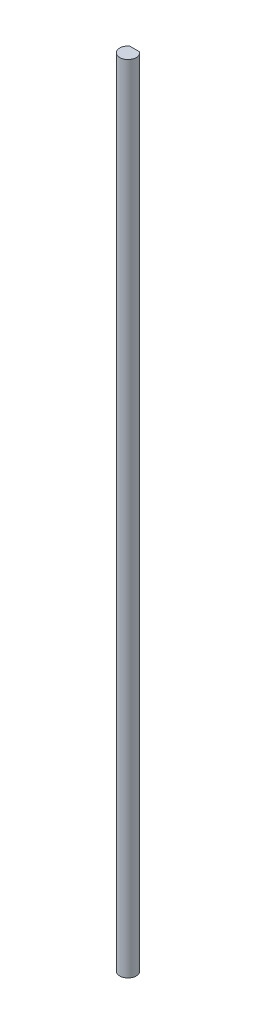
ISO-10303-21;
HEADER;
FILE_DESCRIPTION(('STEP AP214'),'2;1');
FILE_NAME('part.step','',(''),(''),'','','');
FILE_SCHEMA(('AUTOMOTIVE_DESIGN { 1 0 10303 214 1 1 1 1 }'));
ENDSEC;
DATA;
#1=APPLICATION_CONTEXT('core data for automotive mechanical design processes');
#2=APPLICATION_PROTOCOL_DEFINITION('international standard','automotive_design',2000,#1);
#3=PRODUCT_CONTEXT('',#1,'mechanical');
#4=PRODUCT('Part','Part','',(#3));
#5=PRODUCT_RELATED_PRODUCT_CATEGORY('part','',(#4));
#6=PRODUCT_DEFINITION_FORMATION('','',#4);
#7=PRODUCT_DEFINITION_CONTEXT('part definition',#1,'design');
#8=PRODUCT_DEFINITION('design','',#6,#7);
#9=PRODUCT_DEFINITION_SHAPE('','',#8);
#10=(LENGTH_UNIT() NAMED_UNIT(*) SI_UNIT(.MILLI.,.METRE.));
#11=(NAMED_UNIT(*) PLANE_ANGLE_UNIT() SI_UNIT($,.RADIAN.));
#12=(NAMED_UNIT(*) SI_UNIT($,.STERADIAN.) SOLID_ANGLE_UNIT());
#13=UNCERTAINTY_MEASURE_WITH_UNIT(LENGTH_MEASURE(1.E-05),#10,'distance_accuracy_value','');
#14=(GEOMETRIC_REPRESENTATION_CONTEXT(3) GLOBAL_UNCERTAINTY_ASSIGNED_CONTEXT((#13)) GLOBAL_UNIT_ASSIGNED_CONTEXT((#10,
#11,#12)) REPRESENTATION_CONTEXT('',''));
#15=CARTESIAN_POINT('',(0.,0.,0.));
#16=DIRECTION('',(0.,0.,1.));
#17=DIRECTION('',(1.,0.,0.));
#18=AXIS2_PLACEMENT_3D('',#15,#16,#17);
#19=CARTESIAN_POINT('',(0.,304.8,0.));
#20=DIRECTION('',(0.,-1.,0.));
#21=DIRECTION('',(0.,0.,-1.));
#22=AXIS2_PLACEMENT_3D('',#19,#20,#21);
#23=CYLINDRICAL_SURFACE('',#22,3.175);
#24=CARTESIAN_POINT('',(0.,0.,0.));
#25=DIRECTION('',(0.,1.,0.));
#26=DIRECTION('',(0.,0.,1.));
#27=AXIS2_PLACEMENT_3D('',#24,#25,#26);
#28=CIRCLE('',#27,3.175);
#29=CARTESIAN_POINT('',(-1.905,0.,-2.54));
#30=VERTEX_POINT('',#29);
#31=CARTESIAN_POINT('',(1.905,0.,-2.54));
#32=VERTEX_POINT('',#31);
#33=EDGE_CURVE('E64',#30,#32,#28,.T.);
#34=ORIENTED_EDGE('',*,*,#33,.T.);
#35=DIRECTION('',(0.,-1.,0.));
#36=VECTOR('',#35,1.);
#37=CARTESIAN_POINT('',(1.905,304.8,-2.54));
#38=LINE('',#37,#36);
#39=CARTESIAN_POINT('',(1.905,304.8,-2.54));
#40=VERTEX_POINT('',#39);
#41=EDGE_CURVE('E11',#40,#32,#38,.T.);
#42=ORIENTED_EDGE('',*,*,#41,.F.);
#43=CARTESIAN_POINT('',(0.,304.8,0.));
#44=DIRECTION('',(0.,1.,0.));
#45=DIRECTION('',(0.,0.,1.));
#46=AXIS2_PLACEMENT_3D('',#43,#44,#45);
#47=CIRCLE('',#46,3.175);
#48=CARTESIAN_POINT('',(-1.905,304.8,-2.54));
#49=VERTEX_POINT('',#48);
#50=EDGE_CURVE('E63',#49,#40,#47,.T.);
#51=ORIENTED_EDGE('',*,*,#50,.F.);
#52=DIRECTION('',(0.,-1.,0.));
#53=VECTOR('',#52,1.);
#54=CARTESIAN_POINT('',(-1.905,304.8,-2.54));
#55=LINE('',#54,#53);
#56=EDGE_CURVE('E41',#49,#30,#55,.T.);
#57=ORIENTED_EDGE('',*,*,#56,.T.);
#58=EDGE_LOOP('',(#34,#42,#51,#57));
#59=FACE_BOUND('',#58,.T.);
#60=ADVANCED_FACE('F33',(#59),#23,.T.);
#61=CARTESIAN_POINT('',(-1.905,304.8,-2.54));
#62=DIRECTION('',(0.,0.,1.));
#63=DIRECTION('',(1.,0.,0.));
#64=AXIS2_PLACEMENT_3D('',#61,#62,#63);
#65=PLANE('',#64);
#66=DIRECTION('',(-1.,0.,0.));
#67=VECTOR('',#66,1.);
#68=CARTESIAN_POINT('',(-1.905,0.,-2.54));
#69=LINE('',#68,#67);
#70=EDGE_CURVE('E56',#32,#30,#69,.T.);
#71=ORIENTED_EDGE('',*,*,#70,.T.);
#72=ORIENTED_EDGE('',*,*,#56,.F.);
#73=DIRECTION('',(-1.,0.,0.));
#74=VECTOR('',#73,1.);
#75=CARTESIAN_POINT('',(-1.905,304.8,-2.54));
#76=LINE('',#75,#74);
#77=EDGE_CURVE('E48',#40,#49,#76,.T.);
#78=ORIENTED_EDGE('',*,*,#77,.F.);
#79=ORIENTED_EDGE('',*,*,#41,.T.);
#80=EDGE_LOOP('',(#71,#72,#78,#79));
#81=FACE_BOUND('',#80,.T.);
#82=ADVANCED_FACE('F59',(#81),#65,.F.);
#83=CARTESIAN_POINT('',(0.,304.8,0.));
#84=DIRECTION('',(0.,1.,0.));
#85=DIRECTION('',(0.,0.,1.));
#86=AXIS2_PLACEMENT_3D('',#83,#84,#85);
#87=PLANE('',#86);
#88=ORIENTED_EDGE('',*,*,#50,.T.);
#89=ORIENTED_EDGE('',*,*,#77,.T.);
#90=EDGE_LOOP('',(#88,#89));
#91=FACE_BOUND('',#90,.T.);
#92=ADVANCED_FACE('F71',(#91),#87,.T.);
#93=CARTESIAN_POINT('',(0.,0.,0.));
#94=DIRECTION('',(0.,1.,0.));
#95=DIRECTION('',(0.,0.,1.));
#96=AXIS2_PLACEMENT_3D('',#93,#94,#95);
#97=PLANE('',#96);
#98=ORIENTED_EDGE('',*,*,#33,.F.);
#99=ORIENTED_EDGE('',*,*,#70,.F.);
#100=EDGE_LOOP('',(#98,#99));
#101=FACE_BOUND('',#100,.T.);
#102=ADVANCED_FACE('F67',(#101),#97,.F.);
#103=CLOSED_SHELL('',(#60,#82,#92,#102));
#104=MANIFOLD_SOLID_BREP('B2',#103);
#105=ADVANCED_BREP_SHAPE_REPRESENTATION('',(#18,#104),#14);
#106=SHAPE_DEFINITION_REPRESENTATION(#9,#105);
ENDSEC;
END-ISO-10303-21;
